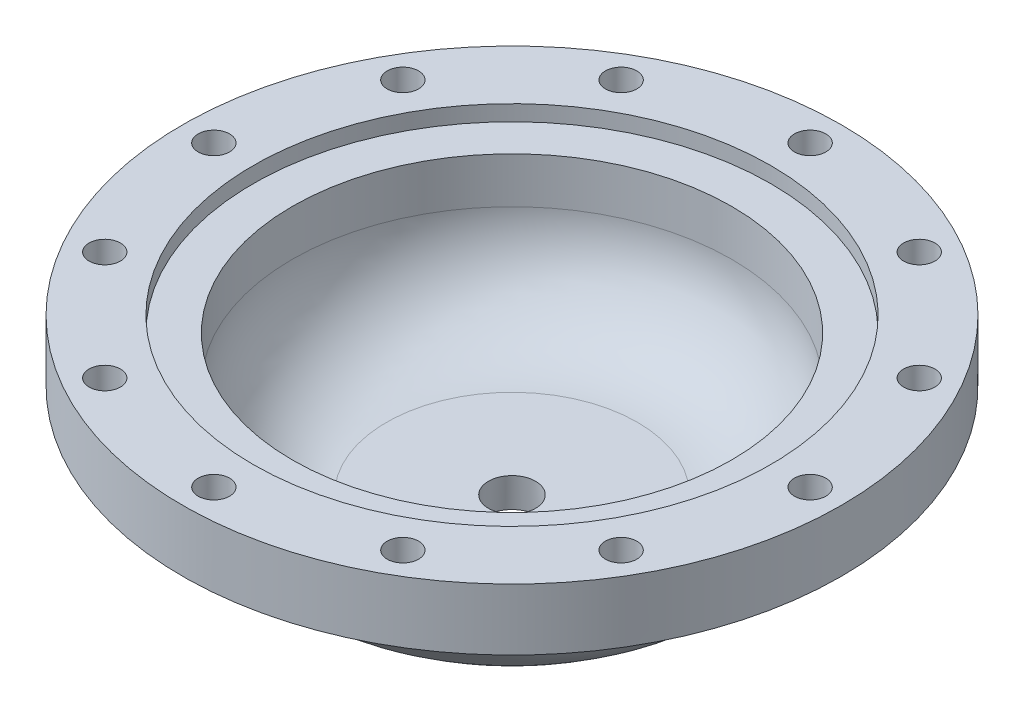
ISO-10303-21;
HEADER;
FILE_DESCRIPTION(('STEP AP214'),'2;1');
FILE_NAME('part.step','',(''),(''),'','','');
FILE_SCHEMA(('AUTOMOTIVE_DESIGN { 1 0 10303 214 1 1 1 1 }'));
ENDSEC;
DATA;
#1=APPLICATION_CONTEXT('core data for automotive mechanical design processes');
#2=APPLICATION_PROTOCOL_DEFINITION('international standard','automotive_design',2000,#1);
#3=PRODUCT_CONTEXT('',#1,'mechanical');
#4=PRODUCT('Part','Part','',(#3));
#5=PRODUCT_RELATED_PRODUCT_CATEGORY('part','',(#4));
#6=PRODUCT_DEFINITION_FORMATION('','',#4);
#7=PRODUCT_DEFINITION_CONTEXT('part definition',#1,'design');
#8=PRODUCT_DEFINITION('design','',#6,#7);
#9=PRODUCT_DEFINITION_SHAPE('','',#8);
#10=(LENGTH_UNIT() NAMED_UNIT(*) SI_UNIT(.MILLI.,.METRE.));
#11=(NAMED_UNIT(*) PLANE_ANGLE_UNIT() SI_UNIT($,.RADIAN.));
#12=(NAMED_UNIT(*) SI_UNIT($,.STERADIAN.) SOLID_ANGLE_UNIT());
#13=UNCERTAINTY_MEASURE_WITH_UNIT(LENGTH_MEASURE(1.E-05),#10,'distance_accuracy_value','');
#14=(GEOMETRIC_REPRESENTATION_CONTEXT(3) GLOBAL_UNCERTAINTY_ASSIGNED_CONTEXT((#13)) GLOBAL_UNIT_ASSIGNED_CONTEXT((#10,
#11,#12)) REPRESENTATION_CONTEXT('',''));
#15=CARTESIAN_POINT('',(0.,0.,0.));
#16=DIRECTION('',(0.,0.,1.));
#17=DIRECTION('',(1.,0.,0.));
#18=AXIS2_PLACEMENT_3D('',#15,#16,#17);
#19=CARTESIAN_POINT('',(81.28,-332.595132004085,0.));
#20=DIRECTION('',(0.,1.,0.));
#21=DIRECTION('',(0.,0.,1.));
#22=AXIS2_PLACEMENT_3D('',#19,#20,#21);
#23=CYLINDRICAL_SURFACE('',#22,44.45);
#24=CARTESIAN_POINT('',(81.28,-332.595132004085,0.));
#25=DIRECTION('',(0.,-1.,0.));
#26=DIRECTION('',(0.,0.,-1.));
#27=AXIS2_PLACEMENT_3D('',#24,#25,#26);
#28=CIRCLE('',#27,44.45);
#29=CARTESIAN_POINT('',(81.28,-332.595132004085,-44.45));
#30=VERTEX_POINT('',#29);
#31=EDGE_CURVE('E121',#30,#30,#28,.T.);
#32=ORIENTED_EDGE('',*,*,#31,.T.);
#33=EDGE_LOOP('',(#32));
#34=FACE_BOUND('',#33,.T.);
#35=CARTESIAN_POINT('',(81.28,-323.324132004085,0.));
#36=DIRECTION('',(0.,-1.,0.));
#37=DIRECTION('',(0.,0.,-1.));
#38=AXIS2_PLACEMENT_3D('',#35,#36,#37);
#39=CIRCLE('',#38,44.45);
#40=CARTESIAN_POINT('',(81.28,-323.324132004085,-44.45));
#41=VERTEX_POINT('',#40);
#42=EDGE_CURVE('E70',#41,#41,#39,.T.);
#43=ORIENTED_EDGE('',*,*,#42,.F.);
#44=EDGE_LOOP('',(#43));
#45=FACE_BOUND('',#44,.T.);
#46=ADVANCED_FACE('F14',(#34,#45),#23,.F.);
#47=CARTESIAN_POINT('',(81.28,-332.595132004085,60.325));
#48=DIRECTION('',(0.,1.,0.));
#49=DIRECTION('',(0.,0.,1.));
#50=AXIS2_PLACEMENT_3D('',#47,#48,#49);
#51=CYLINDRICAL_SURFACE('',#50,3.175);
#52=CARTESIAN_POINT('',(81.28,-332.595132004085,60.325));
#53=DIRECTION('',(0.,1.,0.));
#54=DIRECTION('',(0.,0.,1.));
#55=AXIS2_PLACEMENT_3D('',#52,#53,#54);
#56=CIRCLE('',#55,3.175);
#57=CARTESIAN_POINT('',(81.28,-332.595132004085,63.5));
#58=VERTEX_POINT('',#57);
#59=EDGE_CURVE('E28',#58,#58,#56,.T.);
#60=ORIENTED_EDGE('',*,*,#59,.F.);
#61=EDGE_LOOP('',(#60));
#62=FACE_BOUND('',#61,.T.);
#63=CARTESIAN_POINT('',(81.28,-320.149132004085,60.325));
#64=DIRECTION('',(0.,-1.,0.));
#65=DIRECTION('',(0.,0.,-1.));
#66=AXIS2_PLACEMENT_3D('',#63,#64,#65);
#67=CIRCLE('',#66,3.175);
#68=CARTESIAN_POINT('',(81.28,-320.149132004085,57.15));
#69=VERTEX_POINT('',#68);
#70=EDGE_CURVE('E35',#69,#69,#67,.F.);
#71=ORIENTED_EDGE('',*,*,#70,.T.);
#72=EDGE_LOOP('',(#71));
#73=FACE_BOUND('',#72,.T.);
#74=ADVANCED_FACE('F149',(#62,#73),#51,.F.);
#75=CARTESIAN_POINT('',(111.4425,-332.595132004085,52.2429824832963));
#76=DIRECTION('',(0.,1.,0.));
#77=DIRECTION('',(0.,0.,1.));
#78=AXIS2_PLACEMENT_3D('',#75,#76,#77);
#79=CYLINDRICAL_SURFACE('',#78,3.175);
#80=CARTESIAN_POINT('',(111.4425,-332.595132004085,52.2429824832963));
#81=DIRECTION('',(0.,1.,0.));
#82=DIRECTION('',(0.5,0.,0.866025403784439));
#83=AXIS2_PLACEMENT_3D('',#80,#81,#82);
#84=CIRCLE('',#83,3.175);
#85=CARTESIAN_POINT('',(113.03,-332.595132004085,54.9926131403119));
#86=VERTEX_POINT('',#85);
#87=EDGE_CURVE('E74',#86,#86,#84,.T.);
#88=ORIENTED_EDGE('',*,*,#87,.F.);
#89=EDGE_LOOP('',(#88));
#90=FACE_BOUND('',#89,.T.);
#91=CARTESIAN_POINT('',(111.4425,-320.149132004085,52.2429824832963));
#92=DIRECTION('',(0.,-1.,0.));
#93=DIRECTION('',(0.,0.,-1.));
#94=AXIS2_PLACEMENT_3D('',#91,#92,#93);
#95=CIRCLE('',#94,3.175);
#96=CARTESIAN_POINT('',(111.4425,-320.149132004085,49.0679824832963));
#97=VERTEX_POINT('',#96);
#98=EDGE_CURVE('E38',#97,#97,#95,.F.);
#99=ORIENTED_EDGE('',*,*,#98,.T.);
#100=EDGE_LOOP('',(#99));
#101=FACE_BOUND('',#100,.T.);
#102=ADVANCED_FACE('F154',(#90,#101),#79,.F.);
#103=CARTESIAN_POINT('',(133.522982483296,-332.595132004085,30.1625));
#104=DIRECTION('',(0.,1.,0.));
#105=DIRECTION('',(0.,0.,1.));
#106=AXIS2_PLACEMENT_3D('',#103,#104,#105);
#107=CYLINDRICAL_SURFACE('',#106,3.175);
#108=CARTESIAN_POINT('',(133.522982483296,-332.595132004085,30.1625));
#109=DIRECTION('',(0.,1.,0.));
#110=DIRECTION('',(0.866025403784439,0.,0.5));
#111=AXIS2_PLACEMENT_3D('',#108,#109,#110);
#112=CIRCLE('',#111,3.175);
#113=CARTESIAN_POINT('',(136.272613140312,-332.595132004085,31.75));
#114=VERTEX_POINT('',#113);
#115=EDGE_CURVE('E77',#114,#114,#112,.T.);
#116=ORIENTED_EDGE('',*,*,#115,.F.);
#117=EDGE_LOOP('',(#116));
#118=FACE_BOUND('',#117,.T.);
#119=CARTESIAN_POINT('',(133.522982483296,-320.149132004085,30.1625));
#120=DIRECTION('',(0.,-1.,0.));
#121=DIRECTION('',(0.,0.,-1.));
#122=AXIS2_PLACEMENT_3D('',#119,#120,#121);
#123=CIRCLE('',#122,3.175);
#124=CARTESIAN_POINT('',(133.522982483296,-320.149132004085,26.9875));
#125=VERTEX_POINT('',#124);
#126=EDGE_CURVE('E41',#125,#125,#123,.F.);
#127=ORIENTED_EDGE('',*,*,#126,.T.);
#128=EDGE_LOOP('',(#127));
#129=FACE_BOUND('',#128,.T.);
#130=ADVANCED_FACE('F220',(#118,#129),#107,.F.);
#131=CARTESIAN_POINT('',(141.605,-332.595132004085,0.));
#132=DIRECTION('',(0.,1.,0.));
#133=DIRECTION('',(0.,0.,1.));
#134=AXIS2_PLACEMENT_3D('',#131,#132,#133);
#135=CYLINDRICAL_SURFACE('',#134,3.175);
#136=CARTESIAN_POINT('',(141.605,-332.595132004085,0.));
#137=DIRECTION('',(0.,1.,0.));
#138=DIRECTION('',(1.,0.,0.));
#139=AXIS2_PLACEMENT_3D('',#136,#137,#138);
#140=CIRCLE('',#139,3.175);
#141=CARTESIAN_POINT('',(144.78,-332.595132004085,0.));
#142=VERTEX_POINT('',#141);
#143=EDGE_CURVE('E80',#142,#142,#140,.T.);
#144=ORIENTED_EDGE('',*,*,#143,.F.);
#145=EDGE_LOOP('',(#144));
#146=FACE_BOUND('',#145,.T.);
#147=CARTESIAN_POINT('',(141.605,-320.149132004085,0.));
#148=DIRECTION('',(0.,-1.,0.));
#149=DIRECTION('',(0.,0.,-1.));
#150=AXIS2_PLACEMENT_3D('',#147,#148,#149);
#151=CIRCLE('',#150,3.175);
#152=CARTESIAN_POINT('',(141.605,-320.149132004085,-3.17499999999994));
#153=VERTEX_POINT('',#152);
#154=EDGE_CURVE('E44',#153,#153,#151,.F.);
#155=ORIENTED_EDGE('',*,*,#154,.T.);
#156=EDGE_LOOP('',(#155));
#157=FACE_BOUND('',#156,.T.);
#158=ADVANCED_FACE('F224',(#146,#157),#135,.F.);
#159=CARTESIAN_POINT('',(133.522982483296,-332.595132004085,-30.1625));
#160=DIRECTION('',(0.,1.,0.));
#161=DIRECTION('',(0.,0.,1.));
#162=AXIS2_PLACEMENT_3D('',#159,#160,#161);
#163=CYLINDRICAL_SURFACE('',#162,3.175);
#164=CARTESIAN_POINT('',(133.522982483296,-332.595132004085,-30.1625));
#165=DIRECTION('',(0.,1.,0.));
#166=DIRECTION('',(0.866025403784439,0.,-0.5));
#167=AXIS2_PLACEMENT_3D('',#164,#165,#166);
#168=CIRCLE('',#167,3.175);
#169=CARTESIAN_POINT('',(136.272613140312,-332.595132004085,-31.75));
#170=VERTEX_POINT('',#169);
#171=EDGE_CURVE('E83',#170,#170,#168,.T.);
#172=ORIENTED_EDGE('',*,*,#171,.F.);
#173=EDGE_LOOP('',(#172));
#174=FACE_BOUND('',#173,.T.);
#175=CARTESIAN_POINT('',(133.522982483296,-320.149132004085,-30.1625));
#176=DIRECTION('',(0.,-1.,0.));
#177=DIRECTION('',(0.,0.,-1.));
#178=AXIS2_PLACEMENT_3D('',#175,#176,#177);
#179=CIRCLE('',#178,3.175);
#180=CARTESIAN_POINT('',(133.522982483296,-320.149132004085,-33.3375));
#181=VERTEX_POINT('',#180);
#182=EDGE_CURVE('E47',#181,#181,#179,.F.);
#183=ORIENTED_EDGE('',*,*,#182,.T.);
#184=EDGE_LOOP('',(#183));
#185=FACE_BOUND('',#184,.T.);
#186=ADVANCED_FACE('F228',(#174,#185),#163,.F.);
#187=CARTESIAN_POINT('',(111.4425,-332.595132004085,-52.2429824832962));
#188=DIRECTION('',(0.,1.,0.));
#189=DIRECTION('',(0.,0.,1.));
#190=AXIS2_PLACEMENT_3D('',#187,#188,#189);
#191=CYLINDRICAL_SURFACE('',#190,3.175);
#192=CARTESIAN_POINT('',(111.4425,-332.595132004085,-52.2429824832962));
#193=DIRECTION('',(0.,1.,0.));
#194=DIRECTION('',(0.5,0.,-0.866025403784439));
#195=AXIS2_PLACEMENT_3D('',#192,#193,#194);
#196=CIRCLE('',#195,3.175);
#197=CARTESIAN_POINT('',(113.03,-332.595132004085,-54.9926131403118));
#198=VERTEX_POINT('',#197);
#199=EDGE_CURVE('E86',#198,#198,#196,.T.);
#200=ORIENTED_EDGE('',*,*,#199,.F.);
#201=EDGE_LOOP('',(#200));
#202=FACE_BOUND('',#201,.T.);
#203=CARTESIAN_POINT('',(111.4425,-320.149132004085,-52.2429824832962));
#204=DIRECTION('',(0.,-1.,0.));
#205=DIRECTION('',(0.,0.,-1.));
#206=AXIS2_PLACEMENT_3D('',#203,#204,#205);
#207=CIRCLE('',#206,3.175);
#208=CARTESIAN_POINT('',(111.4425,-320.149132004085,-55.4179824832962));
#209=VERTEX_POINT('',#208);
#210=EDGE_CURVE('E50',#209,#209,#207,.F.);
#211=ORIENTED_EDGE('',*,*,#210,.T.);
#212=EDGE_LOOP('',(#211));
#213=FACE_BOUND('',#212,.T.);
#214=ADVANCED_FACE('F232',(#202,#213),#191,.F.);
#215=CARTESIAN_POINT('',(81.28,-332.595132004085,-60.325));
#216=DIRECTION('',(0.,1.,0.));
#217=DIRECTION('',(0.,0.,1.));
#218=AXIS2_PLACEMENT_3D('',#215,#216,#217);
#219=CYLINDRICAL_SURFACE('',#218,3.175);
#220=CARTESIAN_POINT('',(81.28,-332.595132004085,-60.325));
#221=DIRECTION('',(0.,1.,0.));
#222=DIRECTION('',(0.,0.,-1.));
#223=AXIS2_PLACEMENT_3D('',#220,#221,#222);
#224=CIRCLE('',#223,3.175);
#225=CARTESIAN_POINT('',(81.28,-332.595132004085,-63.5));
#226=VERTEX_POINT('',#225);
#227=EDGE_CURVE('E89',#226,#226,#224,.T.);
#228=ORIENTED_EDGE('',*,*,#227,.F.);
#229=EDGE_LOOP('',(#228));
#230=FACE_BOUND('',#229,.T.);
#231=CARTESIAN_POINT('',(81.28,-320.149132004085,-60.325));
#232=DIRECTION('',(0.,-1.,0.));
#233=DIRECTION('',(0.,0.,-1.));
#234=AXIS2_PLACEMENT_3D('',#231,#232,#233);
#235=CIRCLE('',#234,3.175);
#236=CARTESIAN_POINT('',(81.28,-320.149132004085,-63.5));
#237=VERTEX_POINT('',#236);
#238=EDGE_CURVE('E53',#237,#237,#235,.F.);
#239=ORIENTED_EDGE('',*,*,#238,.T.);
#240=EDGE_LOOP('',(#239));
#241=FACE_BOUND('',#240,.T.);
#242=ADVANCED_FACE('F236',(#230,#241),#219,.F.);
#243=CARTESIAN_POINT('',(51.1175,-332.595132004085,-52.2429824832962));
#244=DIRECTION('',(0.,1.,0.));
#245=DIRECTION('',(0.,0.,1.));
#246=AXIS2_PLACEMENT_3D('',#243,#244,#245);
#247=CYLINDRICAL_SURFACE('',#246,3.175);
#248=CARTESIAN_POINT('',(51.1175,-332.595132004085,-52.2429824832962));
#249=DIRECTION('',(0.,1.,0.));
#250=DIRECTION('',(-0.5,0.,-0.866025403784439));
#251=AXIS2_PLACEMENT_3D('',#248,#249,#250);
#252=CIRCLE('',#251,3.175);
#253=CARTESIAN_POINT('',(49.53,-332.595132004085,-54.9926131403118));
#254=VERTEX_POINT('',#253);
#255=EDGE_CURVE('E92',#254,#254,#252,.T.);
#256=ORIENTED_EDGE('',*,*,#255,.F.);
#257=EDGE_LOOP('',(#256));
#258=FACE_BOUND('',#257,.T.);
#259=CARTESIAN_POINT('',(51.1175,-320.149132004085,-52.2429824832962));
#260=DIRECTION('',(0.,-1.,0.));
#261=DIRECTION('',(0.,0.,-1.));
#262=AXIS2_PLACEMENT_3D('',#259,#260,#261);
#263=CIRCLE('',#262,3.175);
#264=CARTESIAN_POINT('',(51.1175,-320.149132004085,-55.4179824832962));
#265=VERTEX_POINT('',#264);
#266=EDGE_CURVE('E56',#265,#265,#263,.F.);
#267=ORIENTED_EDGE('',*,*,#266,.T.);
#268=EDGE_LOOP('',(#267));
#269=FACE_BOUND('',#268,.T.);
#270=ADVANCED_FACE('F240',(#258,#269),#247,.F.);
#271=CARTESIAN_POINT('',(29.0370175167038,-332.595132004085,-30.1625));
#272=DIRECTION('',(0.,1.,0.));
#273=DIRECTION('',(0.,0.,1.));
#274=AXIS2_PLACEMENT_3D('',#271,#272,#273);
#275=CYLINDRICAL_SURFACE('',#274,3.175);
#276=CARTESIAN_POINT('',(29.0370175167038,-332.595132004085,-30.1625));
#277=DIRECTION('',(0.,1.,0.));
#278=DIRECTION('',(-0.866025403784438,0.,-0.5));
#279=AXIS2_PLACEMENT_3D('',#276,#277,#278);
#280=CIRCLE('',#279,3.175);
#281=CARTESIAN_POINT('',(26.2873868596882,-332.595132004085,-31.75));
#282=VERTEX_POINT('',#281);
#283=EDGE_CURVE('E95',#282,#282,#280,.T.);
#284=ORIENTED_EDGE('',*,*,#283,.F.);
#285=EDGE_LOOP('',(#284));
#286=FACE_BOUND('',#285,.T.);
#287=CARTESIAN_POINT('',(29.0370175167038,-320.149132004085,-30.1625));
#288=DIRECTION('',(0.,-1.,0.));
#289=DIRECTION('',(0.,0.,-1.));
#290=AXIS2_PLACEMENT_3D('',#287,#288,#289);
#291=CIRCLE('',#290,3.175);
#292=CARTESIAN_POINT('',(29.0370175167038,-320.149132004085,-33.3375));
#293=VERTEX_POINT('',#292);
#294=EDGE_CURVE('E59',#293,#293,#291,.F.);
#295=ORIENTED_EDGE('',*,*,#294,.T.);
#296=EDGE_LOOP('',(#295));
#297=FACE_BOUND('',#296,.T.);
#298=ADVANCED_FACE('F244',(#286,#297),#275,.F.);
#299=CARTESIAN_POINT('',(20.955,-332.595132004085,0.));
#300=DIRECTION('',(0.,1.,0.));
#301=DIRECTION('',(0.,0.,1.));
#302=AXIS2_PLACEMENT_3D('',#299,#300,#301);
#303=CYLINDRICAL_SURFACE('',#302,3.175);
#304=CARTESIAN_POINT('',(20.955,-332.595132004085,0.));
#305=DIRECTION('',(0.,1.,0.));
#306=DIRECTION('',(-1.,0.,0.));
#307=AXIS2_PLACEMENT_3D('',#304,#305,#306);
#308=CIRCLE('',#307,3.175);
#309=CARTESIAN_POINT('',(17.78,-332.595132004085,0.));
#310=VERTEX_POINT('',#309);
#311=EDGE_CURVE('E98',#310,#310,#308,.T.);
#312=ORIENTED_EDGE('',*,*,#311,.F.);
#313=EDGE_LOOP('',(#312));
#314=FACE_BOUND('',#313,.T.);
#315=CARTESIAN_POINT('',(20.955,-320.149132004085,0.));
#316=DIRECTION('',(0.,-1.,0.));
#317=DIRECTION('',(0.,0.,-1.));
#318=AXIS2_PLACEMENT_3D('',#315,#316,#317);
#319=CIRCLE('',#318,3.175);
#320=CARTESIAN_POINT('',(20.955,-320.149132004085,-3.17500000000001));
#321=VERTEX_POINT('',#320);
#322=EDGE_CURVE('E62',#321,#321,#319,.F.);
#323=ORIENTED_EDGE('',*,*,#322,.T.);
#324=EDGE_LOOP('',(#323));
#325=FACE_BOUND('',#324,.T.);
#326=ADVANCED_FACE('F248',(#314,#325),#303,.F.);
#327=CARTESIAN_POINT('',(29.0370175167037,-332.595132004085,30.1625));
#328=DIRECTION('',(0.,1.,0.));
#329=DIRECTION('',(0.,0.,1.));
#330=AXIS2_PLACEMENT_3D('',#327,#328,#329);
#331=CYLINDRICAL_SURFACE('',#330,3.175);
#332=CARTESIAN_POINT('',(29.0370175167037,-332.595132004085,30.1625));
#333=DIRECTION('',(0.,1.,0.));
#334=DIRECTION('',(-0.866025403784439,0.,0.5));
#335=AXIS2_PLACEMENT_3D('',#332,#333,#334);
#336=CIRCLE('',#335,3.175);
#337=CARTESIAN_POINT('',(26.2873868596881,-332.595132004085,31.75));
#338=VERTEX_POINT('',#337);
#339=EDGE_CURVE('E101',#338,#338,#336,.T.);
#340=ORIENTED_EDGE('',*,*,#339,.F.);
#341=EDGE_LOOP('',(#340));
#342=FACE_BOUND('',#341,.T.);
#343=CARTESIAN_POINT('',(29.0370175167037,-320.149132004085,30.1625));
#344=DIRECTION('',(0.,-1.,0.));
#345=DIRECTION('',(0.,0.,-1.));
#346=AXIS2_PLACEMENT_3D('',#343,#344,#345);
#347=CIRCLE('',#346,3.175);
#348=CARTESIAN_POINT('',(29.0370175167037,-320.149132004085,26.9875));
#349=VERTEX_POINT('',#348);
#350=EDGE_CURVE('E65',#349,#349,#347,.F.);
#351=ORIENTED_EDGE('',*,*,#350,.T.);
#352=EDGE_LOOP('',(#351));
#353=FACE_BOUND('',#352,.T.);
#354=ADVANCED_FACE('F213',(#342,#353),#331,.F.);
#355=CARTESIAN_POINT('',(51.1175,-332.595132004085,52.2429824832962));
#356=DIRECTION('',(0.,1.,0.));
#357=DIRECTION('',(0.,0.,1.));
#358=AXIS2_PLACEMENT_3D('',#355,#356,#357);
#359=CYLINDRICAL_SURFACE('',#358,3.175);
#360=CARTESIAN_POINT('',(51.1175,-332.595132004085,52.2429824832962));
#361=DIRECTION('',(0.,1.,0.));
#362=DIRECTION('',(-0.5,0.,0.866025403784438));
#363=AXIS2_PLACEMENT_3D('',#360,#361,#362);
#364=CIRCLE('',#363,3.175);
#365=CARTESIAN_POINT('',(49.53,-332.595132004085,54.9926131403118));
#366=VERTEX_POINT('',#365);
#367=EDGE_CURVE('E34',#366,#366,#364,.T.);
#368=ORIENTED_EDGE('',*,*,#367,.F.);
#369=EDGE_LOOP('',(#368));
#370=FACE_BOUND('',#369,.T.);
#371=CARTESIAN_POINT('',(51.1175,-320.149132004085,52.2429824832962));
#372=DIRECTION('',(0.,-1.,0.));
#373=DIRECTION('',(0.,0.,-1.));
#374=AXIS2_PLACEMENT_3D('',#371,#372,#373);
#375=CIRCLE('',#374,3.175);
#376=CARTESIAN_POINT('',(51.1175,-320.149132004085,49.0679824832962));
#377=VERTEX_POINT('',#376);
#378=EDGE_CURVE('E68',#377,#377,#375,.F.);
#379=ORIENTED_EDGE('',*,*,#378,.T.);
#380=EDGE_LOOP('',(#379));
#381=FACE_BOUND('',#380,.T.);
#382=ADVANCED_FACE('F205',(#370,#381),#359,.F.);
#383=CARTESIAN_POINT('',(81.28,-332.595132004085,0.));
#384=DIRECTION('',(0.,1.,0.));
#385=DIRECTION('',(0.,0.,1.));
#386=AXIS2_PLACEMENT_3D('',#383,#384,#385);
#387=CYLINDRICAL_SURFACE('',#386,66.675);
#388=CARTESIAN_POINT('',(81.28,-332.595132004085,0.));
#389=DIRECTION('',(0.,-1.,0.));
#390=DIRECTION('',(1.,0.,0.));
#391=AXIS2_PLACEMENT_3D('',#388,#389,#390);
#392=CIRCLE('',#391,66.675);
#393=CARTESIAN_POINT('',(147.955,-332.595132004085,0.));
#394=VERTEX_POINT('',#393);
#395=EDGE_CURVE('E24',#394,#394,#392,.T.);
#396=ORIENTED_EDGE('',*,*,#395,.F.);
#397=EDGE_LOOP('',(#396));
#398=FACE_BOUND('',#397,.T.);
#399=CARTESIAN_POINT('',(81.28,-320.149132004085,0.));
#400=DIRECTION('',(0.,-1.,0.));
#401=DIRECTION('',(0.,0.,-1.));
#402=AXIS2_PLACEMENT_3D('',#399,#400,#401);
#403=CIRCLE('',#402,66.675);
#404=CARTESIAN_POINT('',(81.28,-320.149132004085,-66.675));
#405=VERTEX_POINT('',#404);
#406=EDGE_CURVE('E31',#405,#405,#403,.T.);
#407=ORIENTED_EDGE('',*,*,#406,.T.);
#408=EDGE_LOOP('',(#407));
#409=FACE_BOUND('',#408,.T.);
#410=ADVANCED_FACE('F203',(#398,#409),#387,.T.);
#411=CARTESIAN_POINT('',(81.28,-332.595132004085,0.));
#412=DIRECTION('',(0.,-1.,0.));
#413=DIRECTION('',(0.,0.,-1.));
#414=AXIS2_PLACEMENT_3D('',#411,#412,#413);
#415=PLANE('',#414);
#416=CARTESIAN_POINT('',(81.28,-332.595132004085,0.));
#417=DIRECTION('',(0.,-1.,0.));
#418=DIRECTION('',(0.,0.,-1.));
#419=AXIS2_PLACEMENT_3D('',#416,#417,#418);
#420=CIRCLE('',#419,53.7980633142473);
#421=CARTESIAN_POINT('',(81.28,-332.595132004085,-53.7980633142473));
#422=VERTEX_POINT('',#421);
#423=EDGE_CURVE('E10',#422,#422,#420,.F.);
#424=ORIENTED_EDGE('',*,*,#423,.T.);
#425=EDGE_LOOP('',(#424));
#426=FACE_BOUND('',#425,.T.);
#427=ORIENTED_EDGE('',*,*,#367,.T.);
#428=EDGE_LOOP('',(#427));
#429=FACE_BOUND('',#428,.T.);
#430=ORIENTED_EDGE('',*,*,#339,.T.);
#431=EDGE_LOOP('',(#430));
#432=FACE_BOUND('',#431,.T.);
#433=ORIENTED_EDGE('',*,*,#311,.T.);
#434=EDGE_LOOP('',(#433));
#435=FACE_BOUND('',#434,.T.);
#436=ORIENTED_EDGE('',*,*,#283,.T.);
#437=EDGE_LOOP('',(#436));
#438=FACE_BOUND('',#437,.T.);
#439=ORIENTED_EDGE('',*,*,#255,.T.);
#440=EDGE_LOOP('',(#439));
#441=FACE_BOUND('',#440,.T.);
#442=ORIENTED_EDGE('',*,*,#227,.T.);
#443=EDGE_LOOP('',(#442));
#444=FACE_BOUND('',#443,.T.);
#445=ORIENTED_EDGE('',*,*,#199,.T.);
#446=EDGE_LOOP('',(#445));
#447=FACE_BOUND('',#446,.T.);
#448=ORIENTED_EDGE('',*,*,#171,.T.);
#449=EDGE_LOOP('',(#448));
#450=FACE_BOUND('',#449,.T.);
#451=ORIENTED_EDGE('',*,*,#143,.T.);
#452=EDGE_LOOP('',(#451));
#453=FACE_BOUND('',#452,.T.);
#454=ORIENTED_EDGE('',*,*,#115,.T.);
#455=EDGE_LOOP('',(#454));
#456=FACE_BOUND('',#455,.T.);
#457=ORIENTED_EDGE('',*,*,#87,.T.);
#458=EDGE_LOOP('',(#457));
#459=FACE_BOUND('',#458,.T.);
#460=ORIENTED_EDGE('',*,*,#59,.T.);
#461=EDGE_LOOP('',(#460));
#462=FACE_BOUND('',#461,.T.);
#463=ORIENTED_EDGE('',*,*,#395,.T.);
#464=EDGE_LOOP('',(#463));
#465=FACE_BOUND('',#464,.T.);
#466=ADVANCED_FACE('F176',(#426,#429,#432,#435,#438,#441,#444,#447,#450,#453,#456,#459,#462,
#465),#415,.T.);
#467=CARTESIAN_POINT('',(81.28,-320.149132004085,0.));
#468=DIRECTION('',(0.,-1.,0.));
#469=DIRECTION('',(0.,0.,-1.));
#470=AXIS2_PLACEMENT_3D('',#467,#468,#469);
#471=PLANE('',#470);
#472=CARTESIAN_POINT('',(81.28,-320.149132004085,0.));
#473=DIRECTION('',(0.,-1.,0.));
#474=DIRECTION('',(0.,0.,-1.));
#475=AXIS2_PLACEMENT_3D('',#472,#473,#474);
#476=CIRCLE('',#475,52.3875);
#477=CARTESIAN_POINT('',(81.28,-320.149132004085,-52.3875));
#478=VERTEX_POINT('',#477);
#479=EDGE_CURVE('E108',#478,#478,#476,.T.);
#480=ORIENTED_EDGE('',*,*,#479,.T.);
#481=EDGE_LOOP('',(#480));
#482=FACE_BOUND('',#481,.T.);
#483=ORIENTED_EDGE('',*,*,#378,.F.);
#484=EDGE_LOOP('',(#483));
#485=FACE_BOUND('',#484,.T.);
#486=ORIENTED_EDGE('',*,*,#350,.F.);
#487=EDGE_LOOP('',(#486));
#488=FACE_BOUND('',#487,.T.);
#489=ORIENTED_EDGE('',*,*,#322,.F.);
#490=EDGE_LOOP('',(#489));
#491=FACE_BOUND('',#490,.T.);
#492=ORIENTED_EDGE('',*,*,#294,.F.);
#493=EDGE_LOOP('',(#492));
#494=FACE_BOUND('',#493,.T.);
#495=ORIENTED_EDGE('',*,*,#266,.F.);
#496=EDGE_LOOP('',(#495));
#497=FACE_BOUND('',#496,.T.);
#498=ORIENTED_EDGE('',*,*,#238,.F.);
#499=EDGE_LOOP('',(#498));
#500=FACE_BOUND('',#499,.T.);
#501=ORIENTED_EDGE('',*,*,#210,.F.);
#502=EDGE_LOOP('',(#501));
#503=FACE_BOUND('',#502,.T.);
#504=ORIENTED_EDGE('',*,*,#182,.F.);
#505=EDGE_LOOP('',(#504));
#506=FACE_BOUND('',#505,.T.);
#507=ORIENTED_EDGE('',*,*,#154,.F.);
#508=EDGE_LOOP('',(#507));
#509=FACE_BOUND('',#508,.T.);
#510=ORIENTED_EDGE('',*,*,#126,.F.);
#511=EDGE_LOOP('',(#510));
#512=FACE_BOUND('',#511,.T.);
#513=ORIENTED_EDGE('',*,*,#98,.F.);
#514=EDGE_LOOP('',(#513));
#515=FACE_BOUND('',#514,.T.);
#516=ORIENTED_EDGE('',*,*,#70,.F.);
#517=EDGE_LOOP('',(#516));
#518=FACE_BOUND('',#517,.T.);
#519=ORIENTED_EDGE('',*,*,#406,.F.);
#520=EDGE_LOOP('',(#519));
#521=FACE_BOUND('',#520,.T.);
#522=ADVANCED_FACE('F165',(#482,#485,#488,#491,#494,#497,#500,#503,#506,#509,#512,#515,#518,
#521),#471,.F.);
#523=CARTESIAN_POINT('',(81.28,-323.324132004085,0.));
#524=DIRECTION('',(0.,1.,0.));
#525=DIRECTION('',(0.,0.,1.));
#526=AXIS2_PLACEMENT_3D('',#523,#524,#525);
#527=PLANE('',#526);
#528=ORIENTED_EDGE('',*,*,#42,.T.);
#529=EDGE_LOOP('',(#528));
#530=FACE_BOUND('',#529,.T.);
#531=CARTESIAN_POINT('',(81.28,-323.324132004085,0.));
#532=DIRECTION('',(0.,-1.,0.));
#533=DIRECTION('',(0.,0.,-1.));
#534=AXIS2_PLACEMENT_3D('',#531,#532,#533);
#535=CIRCLE('',#534,52.3875);
#536=CARTESIAN_POINT('',(81.28,-323.324132004085,-52.3875));
#537=VERTEX_POINT('',#536);
#538=EDGE_CURVE('E111',#537,#537,#535,.T.);
#539=ORIENTED_EDGE('',*,*,#538,.F.);
#540=EDGE_LOOP('',(#539));
#541=FACE_BOUND('',#540,.T.);
#542=ADVANCED_FACE('F161',(#530,#541),#527,.T.);
#543=CARTESIAN_POINT('',(81.28,-320.149132004085,0.));
#544=DIRECTION('',(0.,-1.,0.));
#545=DIRECTION('',(0.,0.,-1.));
#546=AXIS2_PLACEMENT_3D('',#543,#544,#545);
#547=CYLINDRICAL_SURFACE('',#546,52.3875);
#548=ORIENTED_EDGE('',*,*,#538,.T.);
#549=EDGE_LOOP('',(#548));
#550=FACE_BOUND('',#549,.T.);
#551=ORIENTED_EDGE('',*,*,#479,.F.);
#552=EDGE_LOOP('',(#551));
#553=FACE_BOUND('',#552,.T.);
#554=ADVANCED_FACE('F164',(#550,#553),#547,.F.);
#555=CARTESIAN_POINT('',(81.28,-357.995132004085,0.));
#556=DIRECTION('',(0.,-1.,0.));
#557=DIRECTION('',(0.,0.,-1.));
#558=AXIS2_PLACEMENT_3D('',#555,#556,#557);
#559=PLANE('',#558);
#560=CARTESIAN_POINT('',(81.28,-357.995132004085,0.));
#561=DIRECTION('',(0.,-1.,0.));
#562=DIRECTION('',(0.,0.,-1.));
#563=AXIS2_PLACEMENT_3D('',#560,#561,#562);
#564=CIRCLE('',#563,5.31805301338962);
#565=CARTESIAN_POINT('',(81.28,-357.995132004085,-5.31805301338962));
#566=VERTEX_POINT('',#565);
#567=EDGE_CURVE('E115',#566,#566,#564,.F.);
#568=ORIENTED_EDGE('',*,*,#567,.T.);
#569=EDGE_LOOP('',(#568));
#570=FACE_BOUND('',#569,.T.);
#571=CARTESIAN_POINT('',(81.28,-357.995132004085,0.));
#572=DIRECTION('',(0.,-1.,0.));
#573=DIRECTION('',(0.,0.,-1.));
#574=AXIS2_PLACEMENT_3D('',#571,#572,#573);
#575=CIRCLE('',#574,25.4);
#576=CARTESIAN_POINT('',(81.28,-357.995132004085,-25.4));
#577=VERTEX_POINT('',#576);
#578=EDGE_CURVE('E114',#577,#577,#575,.T.);
#579=ORIENTED_EDGE('',*,*,#578,.T.);
#580=EDGE_LOOP('',(#579));
#581=FACE_BOUND('',#580,.T.);
#582=ADVANCED_FACE('F145',(#570,#581),#559,.T.);
#583=CARTESIAN_POINT('',(81.28,-332.595132004085,0.));
#584=DIRECTION('',(0.,-1.,0.));
#585=DIRECTION('',(0.,0.,-1.));
#586=AXIS2_PLACEMENT_3D('',#583,#584,#585);
#587=DEGENERATE_TOROIDAL_SURFACE('',#586,25.4,25.4,.T.);
#588=CARTESIAN_POINT('',(81.28,-335.417354226307,0.));
#589=DIRECTION('',(0.,1.,0.));
#590=DIRECTION('',(0.,0.,1.));
#591=AXIS2_PLACEMENT_3D('',#588,#589,#590);
#592=CIRCLE('',#591,50.6427229459976);
#593=CARTESIAN_POINT('',(81.28,-335.417354226307,50.6427229459976));
#594=VERTEX_POINT('',#593);
#595=EDGE_CURVE('E20',#594,#594,#592,.F.);
#596=ORIENTED_EDGE('',*,*,#595,.T.);
#597=EDGE_LOOP('',(#596));
#598=FACE_BOUND('',#597,.T.);
#599=ORIENTED_EDGE('',*,*,#578,.F.);
#600=EDGE_LOOP('',(#599));
#601=FACE_BOUND('',#600,.T.);
#602=ADVANCED_FACE('F134',(#598,#601),#587,.T.);
#603=CARTESIAN_POINT('',(81.28,-351.645132004085,0.));
#604=DIRECTION('',(0.,-1.,0.));
#605=DIRECTION('',(0.,0.,-1.));
#606=AXIS2_PLACEMENT_3D('',#603,#604,#605);
#607=PLANE('',#606);
#608=CARTESIAN_POINT('',(81.28,-351.645132004085,0.));
#609=DIRECTION('',(0.,-1.,0.));
#610=DIRECTION('',(0.,0.,-1.));
#611=AXIS2_PLACEMENT_3D('',#608,#609,#610);
#612=CIRCLE('',#611,4.7625);
#613=CARTESIAN_POINT('',(81.28,-351.645132004085,-4.7625));
#614=VERTEX_POINT('',#613);
#615=EDGE_CURVE('E118',#614,#614,#612,.T.);
#616=ORIENTED_EDGE('',*,*,#615,.T.);
#617=EDGE_LOOP('',(#616));
#618=FACE_BOUND('',#617,.T.);
#619=CARTESIAN_POINT('',(81.28,-351.645132004085,0.));
#620=DIRECTION('',(0.,-1.,0.));
#621=DIRECTION('',(0.,0.,-1.));
#622=AXIS2_PLACEMENT_3D('',#619,#620,#621);
#623=CIRCLE('',#622,25.4);
#624=CARTESIAN_POINT('',(81.28,-351.645132004085,-25.4));
#625=VERTEX_POINT('',#624);
#626=EDGE_CURVE('E124',#625,#625,#623,.T.);
#627=ORIENTED_EDGE('',*,*,#626,.F.);
#628=EDGE_LOOP('',(#627));
#629=FACE_BOUND('',#628,.T.);
#630=ADVANCED_FACE('F132',(#618,#629),#607,.F.);
#631=CARTESIAN_POINT('',(81.28,-332.595132004085,0.));
#632=DIRECTION('',(0.,-1.,0.));
#633=DIRECTION('',(0.,0.,-1.));
#634=AXIS2_PLACEMENT_3D('',#631,#632,#633);
#635=TOROIDAL_SURFACE('',#634,25.4,19.05);
#636=ORIENTED_EDGE('',*,*,#31,.F.);
#637=EDGE_LOOP('',(#636));
#638=FACE_BOUND('',#637,.T.);
#639=ORIENTED_EDGE('',*,*,#626,.T.);
#640=EDGE_LOOP('',(#639));
#641=FACE_BOUND('',#640,.T.);
#642=ADVANCED_FACE('F130',(#638,#641),#635,.F.);
#643=CARTESIAN_POINT('',(81.28,-351.645132004085,0.));
#644=DIRECTION('',(0.,-1.,0.));
#645=DIRECTION('',(0.,0.,-1.));
#646=AXIS2_PLACEMENT_3D('',#643,#644,#645);
#647=CONICAL_SURFACE('',#646,4.7625,0.0872664625997164);
#648=ORIENTED_EDGE('',*,*,#567,.F.);
#649=EDGE_LOOP('',(#648));
#650=FACE_BOUND('',#649,.T.);
#651=ORIENTED_EDGE('',*,*,#615,.F.);
#652=EDGE_LOOP('',(#651));
#653=FACE_BOUND('',#652,.T.);
#654=ADVANCED_FACE('F142',(#650,#653),#647,.F.);
#655=CARTESIAN_POINT('',(81.28,-335.770132004085,0.));
#656=DIRECTION('',(0.,-1.,0.));
#657=DIRECTION('',(0.,0.,-1.));
#658=AXIS2_PLACEMENT_3D('',#655,#656,#657);
#659=TOROIDAL_SURFACE('',#658,53.7980633142473,3.175);
#660=ORIENTED_EDGE('',*,*,#423,.F.);
#661=EDGE_LOOP('',(#660));
#662=FACE_BOUND('',#661,.T.);
#663=ORIENTED_EDGE('',*,*,#595,.F.);
#664=EDGE_LOOP('',(#663));
#665=FACE_BOUND('',#664,.T.);
#666=ADVANCED_FACE('F364',(#662,#665),#659,.F.);
#667=CLOSED_SHELL('',(#46,#74,#102,#130,#158,#186,#214,#242,#270,#298,#326,#354,#382,#410,#466,
#522,#542,#554,#582,#602,#630,#642,#654,#666));
#668=MANIFOLD_SOLID_BREP('B1',#667);
#669=ADVANCED_BREP_SHAPE_REPRESENTATION('',(#18,#668),#14);
#670=SHAPE_DEFINITION_REPRESENTATION(#9,#669);
ENDSEC;
END-ISO-10303-21;
